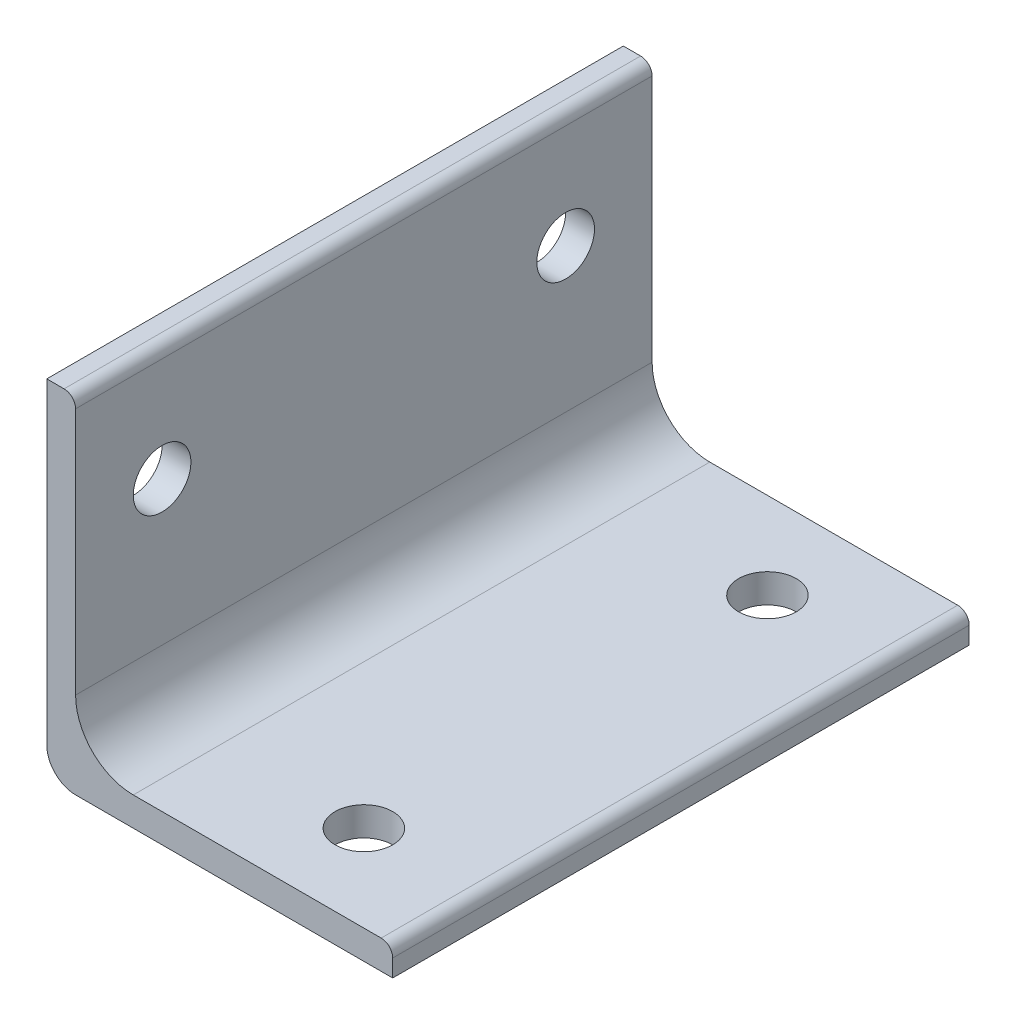
ISO-10303-21;
HEADER;
FILE_DESCRIPTION(('STEP AP214'),'2;1');
FILE_NAME('part.step','',(''),(''),'','','');
FILE_SCHEMA(('AUTOMOTIVE_DESIGN { 1 0 10303 214 1 1 1 1 }'));
ENDSEC;
DATA;
#1=APPLICATION_CONTEXT('core data for automotive mechanical design processes');
#2=APPLICATION_PROTOCOL_DEFINITION('international standard','automotive_design',2000,#1);
#3=PRODUCT_CONTEXT('',#1,'mechanical');
#4=PRODUCT('Part','Part','',(#3));
#5=PRODUCT_RELATED_PRODUCT_CATEGORY('part','',(#4));
#6=PRODUCT_DEFINITION_FORMATION('','',#4);
#7=PRODUCT_DEFINITION_CONTEXT('part definition',#1,'design');
#8=PRODUCT_DEFINITION('design','',#6,#7);
#9=PRODUCT_DEFINITION_SHAPE('','',#8);
#10=(LENGTH_UNIT() NAMED_UNIT(*) SI_UNIT(.MILLI.,.METRE.));
#11=(NAMED_UNIT(*) PLANE_ANGLE_UNIT() SI_UNIT($,.RADIAN.));
#12=(NAMED_UNIT(*) SI_UNIT($,.STERADIAN.) SOLID_ANGLE_UNIT());
#13=UNCERTAINTY_MEASURE_WITH_UNIT(LENGTH_MEASURE(1.E-05),#10,'distance_accuracy_value','');
#14=(GEOMETRIC_REPRESENTATION_CONTEXT(3) GLOBAL_UNCERTAINTY_ASSIGNED_CONTEXT((#13)) GLOBAL_UNIT_ASSIGNED_CONTEXT((#10,
#11,#12)) REPRESENTATION_CONTEXT('',''));
#15=CARTESIAN_POINT('',(0.,0.,0.));
#16=DIRECTION('',(0.,0.,1.));
#17=DIRECTION('',(1.,0.,0.));
#18=AXIS2_PLACEMENT_3D('',#15,#16,#17);
#19=CARTESIAN_POINT('',(33.655,0.,63.5));
#20=DIRECTION('',(0.,-1.,0.));
#21=DIRECTION('',(1.,0.,0.));
#22=AXIS2_PLACEMENT_3D('',#19,#20,#21);
#23=PLANE('',#22);
#24=CARTESIAN_POINT('',(22.225,0.,53.975));
#25=DIRECTION('',(0.,1.,0.));
#26=DIRECTION('',(0.,0.,1.));
#27=AXIS2_PLACEMENT_3D('',#24,#25,#26);
#28=CIRCLE('',#27,3.175);
#29=CARTESIAN_POINT('',(22.225,0.,57.15));
#30=VERTEX_POINT('',#29);
#31=EDGE_CURVE('E271',#30,#30,#28,.T.);
#32=ORIENTED_EDGE('',*,*,#31,.F.);
#33=EDGE_LOOP('',(#32));
#34=FACE_BOUND('',#33,.T.);
#35=DIRECTION('',(-1.,0.,0.));
#36=VECTOR('',#35,1.);
#37=CARTESIAN_POINT('',(33.655,0.,0.));
#38=LINE('',#37,#36);
#39=CARTESIAN_POINT('',(33.655,0.,0.));
#40=VERTEX_POINT('',#39);
#41=CARTESIAN_POINT('',(6.35,0.,0.));
#42=VERTEX_POINT('',#41);
#43=EDGE_CURVE('E98',#40,#42,#38,.T.);
#44=ORIENTED_EDGE('',*,*,#43,.T.);
#45=DIRECTION('',(0.,0.,-1.));
#46=VECTOR('',#45,1.);
#47=CARTESIAN_POINT('',(6.35,0.,63.5));
#48=LINE('',#47,#46);
#49=CARTESIAN_POINT('',(6.35,0.,63.5));
#50=VERTEX_POINT('',#49);
#51=EDGE_CURVE('E149',#50,#42,#48,.T.);
#52=ORIENTED_EDGE('',*,*,#51,.F.);
#53=DIRECTION('',(-1.,0.,0.));
#54=VECTOR('',#53,1.);
#55=CARTESIAN_POINT('',(33.655,0.,63.5));
#56=LINE('',#55,#54);
#57=CARTESIAN_POINT('',(33.655,0.,63.5));
#58=VERTEX_POINT('',#57);
#59=EDGE_CURVE('E57',#58,#50,#56,.T.);
#60=ORIENTED_EDGE('',*,*,#59,.F.);
#61=DIRECTION('',(0.,0.,-1.));
#62=VECTOR('',#61,1.);
#63=CARTESIAN_POINT('',(33.655,0.,63.5));
#64=LINE('',#63,#62);
#65=EDGE_CURVE('E143',#58,#40,#64,.T.);
#66=ORIENTED_EDGE('',*,*,#65,.T.);
#67=EDGE_LOOP('',(#44,#52,#60,#66));
#68=FACE_BOUND('',#67,.T.);
#69=CARTESIAN_POINT('',(22.225,0.,9.525));
#70=DIRECTION('',(0.,1.,0.));
#71=DIRECTION('',(0.,0.,1.));
#72=AXIS2_PLACEMENT_3D('',#69,#70,#71);
#73=CIRCLE('',#72,3.175);
#74=CARTESIAN_POINT('',(22.225,0.,12.7));
#75=VERTEX_POINT('',#74);
#76=EDGE_CURVE('E263',#75,#75,#73,.T.);
#77=ORIENTED_EDGE('',*,*,#76,.F.);
#78=EDGE_LOOP('',(#77));
#79=FACE_BOUND('',#78,.T.);
#80=ADVANCED_FACE('F39',(#34,#68,#79),#23,.F.);
#81=CARTESIAN_POINT('',(6.35,6.34999999999999,63.5));
#82=DIRECTION('',(0.,0.,-1.));
#83=DIRECTION('',(-1.,0.,0.));
#84=AXIS2_PLACEMENT_3D('',#81,#82,#83);
#85=CYLINDRICAL_SURFACE('',#84,6.35);
#86=CARTESIAN_POINT('',(6.35,6.34999999999999,0.));
#87=DIRECTION('',(0.,0.,-1.));
#88=DIRECTION('',(1.,0.,0.));
#89=AXIS2_PLACEMENT_3D('',#86,#87,#88);
#90=CIRCLE('',#89,6.35);
#91=CARTESIAN_POINT('',(0.,6.34999999999999,0.));
#92=VERTEX_POINT('',#91);
#93=EDGE_CURVE('E153',#42,#92,#90,.T.);
#94=ORIENTED_EDGE('',*,*,#93,.T.);
#95=DIRECTION('',(0.,0.,-1.));
#96=VECTOR('',#95,1.);
#97=CARTESIAN_POINT('',(0.,6.34999999999999,63.5));
#98=LINE('',#97,#96);
#99=CARTESIAN_POINT('',(0.,6.34999999999999,63.5));
#100=VERTEX_POINT('',#99);
#101=EDGE_CURVE('E11',#100,#92,#98,.T.);
#102=ORIENTED_EDGE('',*,*,#101,.F.);
#103=CARTESIAN_POINT('',(6.35,6.34999999999999,63.5));
#104=DIRECTION('',(0.,0.,-1.));
#105=DIRECTION('',(1.,0.,0.));
#106=AXIS2_PLACEMENT_3D('',#103,#104,#105);
#107=CIRCLE('',#106,6.35);
#108=EDGE_CURVE('E182',#50,#100,#107,.T.);
#109=ORIENTED_EDGE('',*,*,#108,.F.);
#110=ORIENTED_EDGE('',*,*,#51,.T.);
#111=EDGE_LOOP('',(#94,#102,#109,#110));
#112=FACE_BOUND('',#111,.T.);
#113=ADVANCED_FACE('F41',(#112),#85,.F.);
#114=CARTESIAN_POINT('',(0.,6.34999999999999,63.5));
#115=DIRECTION('',(-1.,0.,0.));
#116=DIRECTION('',(0.,-1.,0.));
#117=AXIS2_PLACEMENT_3D('',#114,#115,#116);
#118=PLANE('',#117);
#119=CARTESIAN_POINT('',(0.,22.225,9.525));
#120=DIRECTION('',(1.,0.,0.));
#121=DIRECTION('',(0.,0.,-1.));
#122=AXIS2_PLACEMENT_3D('',#119,#120,#121);
#123=CIRCLE('',#122,3.175);
#124=CARTESIAN_POINT('',(0.,22.225,6.35));
#125=VERTEX_POINT('',#124);
#126=EDGE_CURVE('E255',#125,#125,#123,.T.);
#127=ORIENTED_EDGE('',*,*,#126,.F.);
#128=EDGE_LOOP('',(#127));
#129=FACE_BOUND('',#128,.T.);
#130=CARTESIAN_POINT('',(0.,22.225,53.975));
#131=DIRECTION('',(1.,0.,0.));
#132=DIRECTION('',(0.,0.,-1.));
#133=AXIS2_PLACEMENT_3D('',#130,#131,#132);
#134=CIRCLE('',#133,3.175);
#135=CARTESIAN_POINT('',(0.,22.225,50.8));
#136=VERTEX_POINT('',#135);
#137=EDGE_CURVE('E247',#136,#136,#134,.T.);
#138=ORIENTED_EDGE('',*,*,#137,.F.);
#139=EDGE_LOOP('',(#138));
#140=FACE_BOUND('',#139,.T.);
#141=DIRECTION('',(0.,1.,0.));
#142=VECTOR('',#141,1.);
#143=CARTESIAN_POINT('',(0.,6.34999999999999,0.));
#144=LINE('',#143,#142);
#145=CARTESIAN_POINT('',(0.,33.655,0.));
#146=VERTEX_POINT('',#145);
#147=EDGE_CURVE('E157',#92,#146,#144,.T.);
#148=ORIENTED_EDGE('',*,*,#147,.T.);
#149=DIRECTION('',(0.,0.,-1.));
#150=VECTOR('',#149,1.);
#151=CARTESIAN_POINT('',(0.,33.655,63.5));
#152=LINE('',#151,#150);
#153=CARTESIAN_POINT('',(0.,33.655,63.5));
#154=VERTEX_POINT('',#153);
#155=EDGE_CURVE('E49',#154,#146,#152,.T.);
#156=ORIENTED_EDGE('',*,*,#155,.F.);
#157=DIRECTION('',(0.,1.,0.));
#158=VECTOR('',#157,1.);
#159=CARTESIAN_POINT('',(0.,6.34999999999999,63.5));
#160=LINE('',#159,#158);
#161=EDGE_CURVE('E106',#100,#154,#160,.T.);
#162=ORIENTED_EDGE('',*,*,#161,.F.);
#163=ORIENTED_EDGE('',*,*,#101,.T.);
#164=EDGE_LOOP('',(#148,#156,#162,#163));
#165=FACE_BOUND('',#164,.T.);
#166=ADVANCED_FACE('F324',(#129,#140,#165),#118,.F.);
#167=CARTESIAN_POINT('',(-1.27,33.655,63.5));
#168=DIRECTION('',(0.,0.,-1.));
#169=DIRECTION('',(-1.,0.,0.));
#170=AXIS2_PLACEMENT_3D('',#167,#168,#169);
#171=CYLINDRICAL_SURFACE('',#170,1.27);
#172=CARTESIAN_POINT('',(-1.27,33.655,0.));
#173=DIRECTION('',(0.,0.,1.));
#174=DIRECTION('',(1.,0.,0.));
#175=AXIS2_PLACEMENT_3D('',#172,#173,#174);
#176=CIRCLE('',#175,1.27);
#177=CARTESIAN_POINT('',(-1.27,34.925,0.));
#178=VERTEX_POINT('',#177);
#179=EDGE_CURVE('E161',#146,#178,#176,.T.);
#180=ORIENTED_EDGE('',*,*,#179,.T.);
#181=DIRECTION('',(0.,0.,-1.));
#182=VECTOR('',#181,1.);
#183=CARTESIAN_POINT('',(-1.27,34.925,63.5));
#184=LINE('',#183,#182);
#185=CARTESIAN_POINT('',(-1.27,34.925,63.5));
#186=VERTEX_POINT('',#185);
#187=EDGE_CURVE('E201',#186,#178,#184,.T.);
#188=ORIENTED_EDGE('',*,*,#187,.F.);
#189=CARTESIAN_POINT('',(-1.27,33.655,63.5));
#190=DIRECTION('',(0.,0.,1.));
#191=DIRECTION('',(1.,0.,0.));
#192=AXIS2_PLACEMENT_3D('',#189,#190,#191);
#193=CIRCLE('',#192,1.27);
#194=EDGE_CURVE('E211',#154,#186,#193,.T.);
#195=ORIENTED_EDGE('',*,*,#194,.F.);
#196=ORIENTED_EDGE('',*,*,#155,.T.);
#197=EDGE_LOOP('',(#180,#188,#195,#196));
#198=FACE_BOUND('',#197,.T.);
#199=ADVANCED_FACE('F209',(#198),#171,.T.);
#200=CARTESIAN_POINT('',(-1.27,34.925,63.5));
#201=DIRECTION('',(0.,-1.,0.));
#202=DIRECTION('',(0.,0.,-1.));
#203=AXIS2_PLACEMENT_3D('',#200,#201,#202);
#204=PLANE('',#203);
#205=DIRECTION('',(-1.,0.,0.));
#206=VECTOR('',#205,1.);
#207=CARTESIAN_POINT('',(-1.27,34.925,0.));
#208=LINE('',#207,#206);
#209=CARTESIAN_POINT('',(-3.175,34.925,0.));
#210=VERTEX_POINT('',#209);
#211=EDGE_CURVE('E164',#178,#210,#208,.T.);
#212=ORIENTED_EDGE('',*,*,#211,.T.);
#213=DIRECTION('',(0.,0.,-1.));
#214=VECTOR('',#213,1.);
#215=CARTESIAN_POINT('',(-3.175,34.925,63.5));
#216=LINE('',#215,#214);
#217=CARTESIAN_POINT('',(-3.175,34.925,63.5));
#218=VERTEX_POINT('',#217);
#219=EDGE_CURVE('E197',#218,#210,#216,.T.);
#220=ORIENTED_EDGE('',*,*,#219,.F.);
#221=DIRECTION('',(-1.,0.,0.));
#222=VECTOR('',#221,1.);
#223=CARTESIAN_POINT('',(-1.27,34.925,63.5));
#224=LINE('',#223,#222);
#225=EDGE_CURVE('E230',#186,#218,#224,.T.);
#226=ORIENTED_EDGE('',*,*,#225,.F.);
#227=ORIENTED_EDGE('',*,*,#187,.T.);
#228=EDGE_LOOP('',(#212,#220,#226,#227));
#229=FACE_BOUND('',#228,.T.);
#230=ADVANCED_FACE('F220',(#229),#204,.F.);
#231=CARTESIAN_POINT('',(-3.175,34.925,63.5));
#232=DIRECTION('',(1.,0.,0.));
#233=DIRECTION('',(0.,1.,0.));
#234=AXIS2_PLACEMENT_3D('',#231,#232,#233);
#235=PLANE('',#234);
#236=CARTESIAN_POINT('',(-3.17499999999999,22.225,9.525));
#237=DIRECTION('',(1.,0.,0.));
#238=DIRECTION('',(0.,0.,-1.));
#239=AXIS2_PLACEMENT_3D('',#236,#237,#238);
#240=CIRCLE('',#239,3.175);
#241=CARTESIAN_POINT('',(-3.17499999999999,22.225,6.35));
#242=VERTEX_POINT('',#241);
#243=EDGE_CURVE('E251',#242,#242,#240,.T.);
#244=ORIENTED_EDGE('',*,*,#243,.T.);
#245=EDGE_LOOP('',(#244));
#246=FACE_BOUND('',#245,.T.);
#247=CARTESIAN_POINT('',(-3.17499999999999,22.225,53.975));
#248=DIRECTION('',(1.,0.,0.));
#249=DIRECTION('',(0.,0.,-1.));
#250=AXIS2_PLACEMENT_3D('',#247,#248,#249);
#251=CIRCLE('',#250,3.175);
#252=CARTESIAN_POINT('',(-3.17499999999999,22.225,50.8));
#253=VERTEX_POINT('',#252);
#254=EDGE_CURVE('E158',#253,#253,#251,.T.);
#255=ORIENTED_EDGE('',*,*,#254,.T.);
#256=EDGE_LOOP('',(#255));
#257=FACE_BOUND('',#256,.T.);
#258=DIRECTION('',(0.,-1.,0.));
#259=VECTOR('',#258,1.);
#260=CARTESIAN_POINT('',(-3.175,34.925,0.));
#261=LINE('',#260,#259);
#262=CARTESIAN_POINT('',(-3.175,0.,0.));
#263=VERTEX_POINT('',#262);
#264=EDGE_CURVE('E167',#210,#263,#261,.T.);
#265=ORIENTED_EDGE('',*,*,#264,.T.);
#266=DIRECTION('',(0.,0.,-1.));
#267=VECTOR('',#266,1.);
#268=CARTESIAN_POINT('',(-3.175,0.,63.5));
#269=LINE('',#268,#267);
#270=CARTESIAN_POINT('',(-3.175,0.,63.5));
#271=VERTEX_POINT('',#270);
#272=EDGE_CURVE('E193',#271,#263,#269,.T.);
#273=ORIENTED_EDGE('',*,*,#272,.F.);
#274=DIRECTION('',(0.,-1.,0.));
#275=VECTOR('',#274,1.);
#276=CARTESIAN_POINT('',(-3.175,34.925,63.5));
#277=LINE('',#276,#275);
#278=EDGE_CURVE('E226',#218,#271,#277,.T.);
#279=ORIENTED_EDGE('',*,*,#278,.F.);
#280=ORIENTED_EDGE('',*,*,#219,.T.);
#281=EDGE_LOOP('',(#265,#273,#279,#280));
#282=FACE_BOUND('',#281,.T.);
#283=ADVANCED_FACE('F224',(#246,#257,#282),#235,.F.);
#284=CARTESIAN_POINT('',(0.,0.,63.5));
#285=DIRECTION('',(0.,0.,-1.));
#286=DIRECTION('',(-1.,0.,0.));
#287=AXIS2_PLACEMENT_3D('',#284,#285,#286);
#288=CYLINDRICAL_SURFACE('',#287,3.17499999999998);
#289=CARTESIAN_POINT('',(0.,0.,0.));
#290=DIRECTION('',(0.,0.,1.));
#291=DIRECTION('',(1.,0.,0.));
#292=AXIS2_PLACEMENT_3D('',#289,#290,#291);
#293=CIRCLE('',#292,3.17499999999998);
#294=CARTESIAN_POINT('',(0.,-3.17499999999999,0.));
#295=VERTEX_POINT('',#294);
#296=EDGE_CURVE('E170',#263,#295,#293,.T.);
#297=ORIENTED_EDGE('',*,*,#296,.T.);
#298=DIRECTION('',(0.,0.,-1.));
#299=VECTOR('',#298,1.);
#300=CARTESIAN_POINT('',(0.,-3.17499999999999,63.5));
#301=LINE('',#300,#299);
#302=CARTESIAN_POINT('',(0.,-3.17499999999999,63.5));
#303=VERTEX_POINT('',#302);
#304=EDGE_CURVE('E189',#303,#295,#301,.T.);
#305=ORIENTED_EDGE('',*,*,#304,.F.);
#306=CARTESIAN_POINT('',(0.,0.,63.5));
#307=DIRECTION('',(0.,0.,1.));
#308=DIRECTION('',(1.,0.,0.));
#309=AXIS2_PLACEMENT_3D('',#306,#307,#308);
#310=CIRCLE('',#309,3.17499999999998);
#311=EDGE_CURVE('E229',#271,#303,#310,.T.);
#312=ORIENTED_EDGE('',*,*,#311,.F.);
#313=ORIENTED_EDGE('',*,*,#272,.T.);
#314=EDGE_LOOP('',(#297,#305,#312,#313));
#315=FACE_BOUND('',#314,.T.);
#316=ADVANCED_FACE('F313',(#315),#288,.T.);
#317=CARTESIAN_POINT('',(0.,-3.17499999999999,63.5));
#318=DIRECTION('',(0.,1.,0.));
#319=DIRECTION('',(-1.,0.,0.));
#320=AXIS2_PLACEMENT_3D('',#317,#318,#319);
#321=PLANE('',#320);
#322=CARTESIAN_POINT('',(22.225,-3.17499999999999,53.975));
#323=DIRECTION('',(0.,1.,0.));
#324=DIRECTION('',(0.,0.,1.));
#325=AXIS2_PLACEMENT_3D('',#322,#323,#324);
#326=CIRCLE('',#325,3.175);
#327=CARTESIAN_POINT('',(22.225,-3.17499999999999,57.15));
#328=VERTEX_POINT('',#327);
#329=EDGE_CURVE('E267',#328,#328,#326,.T.);
#330=ORIENTED_EDGE('',*,*,#329,.T.);
#331=EDGE_LOOP('',(#330));
#332=FACE_BOUND('',#331,.T.);
#333=CARTESIAN_POINT('',(22.225,-3.17499999999999,9.525));
#334=DIRECTION('',(0.,1.,0.));
#335=DIRECTION('',(0.,0.,1.));
#336=AXIS2_PLACEMENT_3D('',#333,#334,#335);
#337=CIRCLE('',#336,3.175);
#338=CARTESIAN_POINT('',(22.225,-3.17499999999999,12.7));
#339=VERTEX_POINT('',#338);
#340=EDGE_CURVE('E259',#339,#339,#337,.T.);
#341=ORIENTED_EDGE('',*,*,#340,.T.);
#342=EDGE_LOOP('',(#341));
#343=FACE_BOUND('',#342,.T.);
#344=DIRECTION('',(1.,0.,0.));
#345=VECTOR('',#344,1.);
#346=CARTESIAN_POINT('',(0.,-3.17499999999999,0.));
#347=LINE('',#346,#345);
#348=CARTESIAN_POINT('',(34.925,-3.17499999999999,0.));
#349=VERTEX_POINT('',#348);
#350=EDGE_CURVE('E173',#295,#349,#347,.T.);
#351=ORIENTED_EDGE('',*,*,#350,.T.);
#352=DIRECTION('',(0.,0.,-1.));
#353=VECTOR('',#352,1.);
#354=CARTESIAN_POINT('',(34.925,-3.17499999999999,63.5));
#355=LINE('',#354,#353);
#356=CARTESIAN_POINT('',(34.925,-3.17499999999999,63.5));
#357=VERTEX_POINT('',#356);
#358=EDGE_CURVE('E142',#357,#349,#355,.T.);
#359=ORIENTED_EDGE('',*,*,#358,.F.);
#360=DIRECTION('',(1.,0.,0.));
#361=VECTOR('',#360,1.);
#362=CARTESIAN_POINT('',(0.,-3.17499999999999,63.5));
#363=LINE('',#362,#361);
#364=EDGE_CURVE('E131',#303,#357,#363,.T.);
#365=ORIENTED_EDGE('',*,*,#364,.F.);
#366=ORIENTED_EDGE('',*,*,#304,.T.);
#367=EDGE_LOOP('',(#351,#359,#365,#366));
#368=FACE_BOUND('',#367,.T.);
#369=ADVANCED_FACE('F310',(#332,#343,#368),#321,.F.);
#370=CARTESIAN_POINT('',(34.925,-3.17499999999999,63.5));
#371=DIRECTION('',(-1.,0.,0.));
#372=DIRECTION('',(0.,-1.,0.));
#373=AXIS2_PLACEMENT_3D('',#370,#371,#372);
#374=PLANE('',#373);
#375=DIRECTION('',(0.,1.,0.));
#376=VECTOR('',#375,1.);
#377=CARTESIAN_POINT('',(34.925,-3.17499999999999,0.));
#378=LINE('',#377,#376);
#379=CARTESIAN_POINT('',(34.925,-1.27,0.));
#380=VERTEX_POINT('',#379);
#381=EDGE_CURVE('E140',#349,#380,#378,.T.);
#382=ORIENTED_EDGE('',*,*,#381,.T.);
#383=DIRECTION('',(0.,0.,-1.));
#384=VECTOR('',#383,1.);
#385=CARTESIAN_POINT('',(34.925,-1.27,63.5));
#386=LINE('',#385,#384);
#387=CARTESIAN_POINT('',(34.925,-1.27,63.5));
#388=VERTEX_POINT('',#387);
#389=EDGE_CURVE('E137',#388,#380,#386,.T.);
#390=ORIENTED_EDGE('',*,*,#389,.F.);
#391=DIRECTION('',(0.,1.,0.));
#392=VECTOR('',#391,1.);
#393=CARTESIAN_POINT('',(34.925,-3.17499999999999,63.5));
#394=LINE('',#393,#392);
#395=EDGE_CURVE('E125',#357,#388,#394,.T.);
#396=ORIENTED_EDGE('',*,*,#395,.F.);
#397=ORIENTED_EDGE('',*,*,#358,.T.);
#398=EDGE_LOOP('',(#382,#390,#396,#397));
#399=FACE_BOUND('',#398,.T.);
#400=ADVANCED_FACE('F138',(#399),#374,.F.);
#401=CARTESIAN_POINT('',(33.655,-1.27,63.5));
#402=DIRECTION('',(0.,0.,-1.));
#403=DIRECTION('',(-1.,0.,0.));
#404=AXIS2_PLACEMENT_3D('',#401,#402,#403);
#405=CYLINDRICAL_SURFACE('',#404,1.27);
#406=CARTESIAN_POINT('',(33.655,-1.27,0.));
#407=DIRECTION('',(0.,0.,1.));
#408=DIRECTION('',(1.,0.,0.));
#409=AXIS2_PLACEMENT_3D('',#406,#407,#408);
#410=CIRCLE('',#409,1.27);
#411=EDGE_CURVE('E92',#380,#40,#410,.T.);
#412=ORIENTED_EDGE('',*,*,#411,.T.);
#413=ORIENTED_EDGE('',*,*,#65,.F.);
#414=CARTESIAN_POINT('',(33.655,-1.27,63.5));
#415=DIRECTION('',(0.,0.,1.));
#416=DIRECTION('',(1.,0.,0.));
#417=AXIS2_PLACEMENT_3D('',#414,#415,#416);
#418=CIRCLE('',#417,1.27);
#419=EDGE_CURVE('E129',#388,#58,#418,.T.);
#420=ORIENTED_EDGE('',*,*,#419,.F.);
#421=ORIENTED_EDGE('',*,*,#389,.T.);
#422=EDGE_LOOP('',(#412,#413,#420,#421));
#423=FACE_BOUND('',#422,.T.);
#424=ADVANCED_FACE('F145',(#423),#405,.T.);
#425=CARTESIAN_POINT('',(6.35,6.34999999999999,63.5));
#426=DIRECTION('',(0.,0.,1.));
#427=DIRECTION('',(1.,0.,0.));
#428=AXIS2_PLACEMENT_3D('',#425,#426,#427);
#429=PLANE('',#428);
#430=ORIENTED_EDGE('',*,*,#108,.T.);
#431=ORIENTED_EDGE('',*,*,#161,.T.);
#432=ORIENTED_EDGE('',*,*,#194,.T.);
#433=ORIENTED_EDGE('',*,*,#225,.T.);
#434=ORIENTED_EDGE('',*,*,#278,.T.);
#435=ORIENTED_EDGE('',*,*,#311,.T.);
#436=ORIENTED_EDGE('',*,*,#364,.T.);
#437=ORIENTED_EDGE('',*,*,#395,.T.);
#438=ORIENTED_EDGE('',*,*,#419,.T.);
#439=ORIENTED_EDGE('',*,*,#59,.T.);
#440=EDGE_LOOP('',(#430,#431,#432,#433,#434,#435,#436,#437,#438,#439));
#441=FACE_BOUND('',#440,.T.);
#442=ADVANCED_FACE('F127',(#441),#429,.T.);
#443=CARTESIAN_POINT('',(6.35,6.34999999999999,0.));
#444=DIRECTION('',(0.,0.,1.));
#445=DIRECTION('',(1.,0.,0.));
#446=AXIS2_PLACEMENT_3D('',#443,#444,#445);
#447=PLANE('',#446);
#448=ORIENTED_EDGE('',*,*,#93,.F.);
#449=ORIENTED_EDGE('',*,*,#43,.F.);
#450=ORIENTED_EDGE('',*,*,#411,.F.);
#451=ORIENTED_EDGE('',*,*,#381,.F.);
#452=ORIENTED_EDGE('',*,*,#350,.F.);
#453=ORIENTED_EDGE('',*,*,#296,.F.);
#454=ORIENTED_EDGE('',*,*,#264,.F.);
#455=ORIENTED_EDGE('',*,*,#211,.F.);
#456=ORIENTED_EDGE('',*,*,#179,.F.);
#457=ORIENTED_EDGE('',*,*,#147,.F.);
#458=EDGE_LOOP('',(#448,#449,#450,#451,#452,#453,#454,#455,#456,#457));
#459=FACE_BOUND('',#458,.T.);
#460=ADVANCED_FACE('F215',(#459),#447,.F.);
#461=CARTESIAN_POINT('',(0.,22.225,53.975));
#462=DIRECTION('',(1.,0.,0.));
#463=DIRECTION('',(0.,0.,-1.));
#464=AXIS2_PLACEMENT_3D('',#461,#462,#463);
#465=CYLINDRICAL_SURFACE('',#464,3.175);
#466=ORIENTED_EDGE('',*,*,#254,.F.);
#467=EDGE_LOOP('',(#466));
#468=FACE_BOUND('',#467,.T.);
#469=ORIENTED_EDGE('',*,*,#137,.T.);
#470=EDGE_LOOP('',(#469));
#471=FACE_BOUND('',#470,.T.);
#472=ADVANCED_FACE('F294',(#468,#471),#465,.F.);
#473=CARTESIAN_POINT('',(0.,22.225,9.525));
#474=DIRECTION('',(1.,0.,0.));
#475=DIRECTION('',(0.,0.,-1.));
#476=AXIS2_PLACEMENT_3D('',#473,#474,#475);
#477=CYLINDRICAL_SURFACE('',#476,3.175);
#478=ORIENTED_EDGE('',*,*,#243,.F.);
#479=EDGE_LOOP('',(#478));
#480=FACE_BOUND('',#479,.T.);
#481=ORIENTED_EDGE('',*,*,#126,.T.);
#482=EDGE_LOOP('',(#481));
#483=FACE_BOUND('',#482,.T.);
#484=ADVANCED_FACE('F285',(#480,#483),#477,.F.);
#485=CARTESIAN_POINT('',(22.225,0.,9.525));
#486=DIRECTION('',(0.,1.,0.));
#487=DIRECTION('',(0.,0.,1.));
#488=AXIS2_PLACEMENT_3D('',#485,#486,#487);
#489=CYLINDRICAL_SURFACE('',#488,3.175);
#490=ORIENTED_EDGE('',*,*,#340,.F.);
#491=EDGE_LOOP('',(#490));
#492=FACE_BOUND('',#491,.T.);
#493=ORIENTED_EDGE('',*,*,#76,.T.);
#494=EDGE_LOOP('',(#493));
#495=FACE_BOUND('',#494,.T.);
#496=ADVANCED_FACE('F283',(#492,#495),#489,.F.);
#497=CARTESIAN_POINT('',(22.225,0.,53.975));
#498=DIRECTION('',(0.,1.,0.));
#499=DIRECTION('',(0.,0.,1.));
#500=AXIS2_PLACEMENT_3D('',#497,#498,#499);
#501=CYLINDRICAL_SURFACE('',#500,3.175);
#502=ORIENTED_EDGE('',*,*,#329,.F.);
#503=EDGE_LOOP('',(#502));
#504=FACE_BOUND('',#503,.T.);
#505=ORIENTED_EDGE('',*,*,#31,.T.);
#506=EDGE_LOOP('',(#505));
#507=FACE_BOUND('',#506,.T.);
#508=ADVANCED_FACE('F276',(#504,#507),#501,.F.);
#509=CLOSED_SHELL('',(#80,#113,#166,#199,#230,#283,#316,#369,#400,#424,#442,#460,#472,#484,#496,#508));
#510=MANIFOLD_SOLID_BREP('B2',#509);
#511=ADVANCED_BREP_SHAPE_REPRESENTATION('',(#18,#510),#14);
#512=SHAPE_DEFINITION_REPRESENTATION(#9,#511);
ENDSEC;
END-ISO-10303-21;
